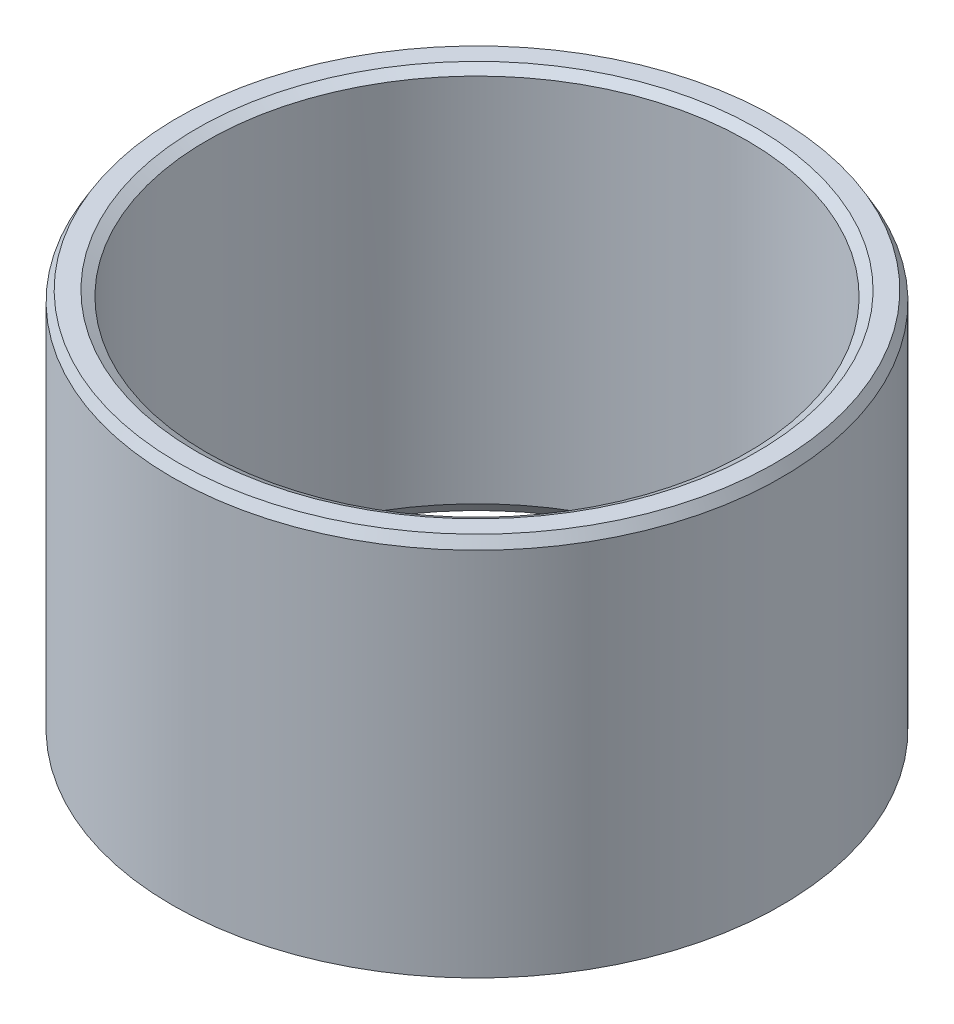
ISO-10303-21;
HEADER;
FILE_DESCRIPTION(('STEP AP214'),'2;1');
FILE_NAME('part.step','',(''),(''),'','','');
FILE_SCHEMA(('AUTOMOTIVE_DESIGN { 1 0 10303 214 1 1 1 1 }'));
ENDSEC;
DATA;
#1=APPLICATION_CONTEXT('core data for automotive mechanical design processes');
#2=APPLICATION_PROTOCOL_DEFINITION('international standard','automotive_design',2000,#1);
#3=PRODUCT_CONTEXT('',#1,'mechanical');
#4=PRODUCT('Part','Part','',(#3));
#5=PRODUCT_RELATED_PRODUCT_CATEGORY('part','',(#4));
#6=PRODUCT_DEFINITION_FORMATION('','',#4);
#7=PRODUCT_DEFINITION_CONTEXT('part definition',#1,'design');
#8=PRODUCT_DEFINITION('design','',#6,#7);
#9=PRODUCT_DEFINITION_SHAPE('','',#8);
#10=(LENGTH_UNIT() NAMED_UNIT(*) SI_UNIT(.MILLI.,.METRE.));
#11=(NAMED_UNIT(*) PLANE_ANGLE_UNIT() SI_UNIT($,.RADIAN.));
#12=(NAMED_UNIT(*) SI_UNIT($,.STERADIAN.) SOLID_ANGLE_UNIT());
#13=UNCERTAINTY_MEASURE_WITH_UNIT(LENGTH_MEASURE(1.E-05),#10,'distance_accuracy_value','');
#14=(GEOMETRIC_REPRESENTATION_CONTEXT(3) GLOBAL_UNCERTAINTY_ASSIGNED_CONTEXT((#13)) GLOBAL_UNIT_ASSIGNED_CONTEXT((#10,
#11,#12)) REPRESENTATION_CONTEXT('',''));
#15=CARTESIAN_POINT('',(0.,0.,0.));
#16=DIRECTION('',(0.,0.,1.));
#17=DIRECTION('',(1.,0.,0.));
#18=AXIS2_PLACEMENT_3D('',#15,#16,#17);
#19=CARTESIAN_POINT('',(0.,66.5105511024131,0.));
#20=DIRECTION('',(0.,-1.,0.));
#21=DIRECTION('',(0.,0.,-1.));
#22=AXIS2_PLACEMENT_3D('',#19,#20,#21);
#23=CYLINDRICAL_SURFACE('',#22,52.5);
#24=CARTESIAN_POINT('',(0.,0.983717591892544,0.));
#25=DIRECTION('',(0.,1.,0.));
#26=DIRECTION('',(0.,0.,1.));
#27=AXIS2_PLACEMENT_3D('',#24,#25,#26);
#28=CIRCLE('',#27,52.5);
#29=CARTESIAN_POINT('',(0.,0.983717591892544,52.5));
#30=VERTEX_POINT('',#29);
#31=EDGE_CURVE('E10',#30,#30,#28,.T.);
#32=ORIENTED_EDGE('',*,*,#31,.T.);
#33=EDGE_LOOP('',(#32));
#34=FACE_BOUND('',#33,.T.);
#35=CARTESIAN_POINT('',(0.,64.8067022529559,0.));
#36=DIRECTION('',(0.,1.,0.));
#37=DIRECTION('',(0.,0.,1.));
#38=AXIS2_PLACEMENT_3D('',#35,#36,#37);
#39=CIRCLE('',#38,52.5);
#40=CARTESIAN_POINT('',(0.,64.8067022529559,52.5));
#41=VERTEX_POINT('',#40);
#42=EDGE_CURVE('E50',#41,#41,#39,.F.);
#43=ORIENTED_EDGE('',*,*,#42,.T.);
#44=EDGE_LOOP('',(#43));
#45=FACE_BOUND('',#44,.T.);
#46=ADVANCED_FACE('F39',(#34,#45),#23,.T.);
#47=CARTESIAN_POINT('',(0.,66.5105511024131,0.));
#48=DIRECTION('',(0.,1.,0.));
#49=DIRECTION('',(0.,0.,1.));
#50=AXIS2_PLACEMENT_3D('',#47,#48,#49);
#51=PLANE('',#50);
#52=CARTESIAN_POINT('',(0.,66.5105511024131,0.));
#53=DIRECTION('',(0.,1.,0.));
#54=DIRECTION('',(0.,0.,1.));
#55=AXIS2_PLACEMENT_3D('',#52,#53,#54);
#56=CIRCLE('',#55,48.2572991377048);
#57=CARTESIAN_POINT('',(0.,66.5105511024131,48.2572991377048));
#58=VERTEX_POINT('',#57);
#59=EDGE_CURVE('E58',#58,#58,#56,.F.);
#60=ORIENTED_EDGE('',*,*,#59,.T.);
#61=EDGE_LOOP('',(#60));
#62=FACE_BOUND('',#61,.T.);
#63=CARTESIAN_POINT('',(0.,66.5105511024131,0.));
#64=DIRECTION('',(0.,1.,0.));
#65=DIRECTION('',(0.,0.,1.));
#66=AXIS2_PLACEMENT_3D('',#63,#64,#65);
#67=CIRCLE('',#66,51.5162824081075);
#68=CARTESIAN_POINT('',(0.,66.5105511024131,51.5162824081075));
#69=VERTEX_POINT('',#68);
#70=EDGE_CURVE('E61',#69,#69,#67,.T.);
#71=ORIENTED_EDGE('',*,*,#70,.T.);
#72=EDGE_LOOP('',(#71));
#73=FACE_BOUND('',#72,.T.);
#74=ADVANCED_FACE('F88',(#62,#73),#51,.T.);
#75=CARTESIAN_POINT('',(0.,0.,0.));
#76=DIRECTION('',(0.,1.,0.));
#77=DIRECTION('',(0.,0.,1.));
#78=AXIS2_PLACEMENT_3D('',#75,#76,#77);
#79=PLANE('',#78);
#80=CARTESIAN_POINT('',(0.,0.,0.));
#81=DIRECTION('',(0.,1.,0.));
#82=DIRECTION('',(0.,0.,1.));
#83=AXIS2_PLACEMENT_3D('',#80,#81,#82);
#84=CIRCLE('',#83,47.5371678801401);
#85=CARTESIAN_POINT('',(0.,0.,-47.5371678801401));
#86=VERTEX_POINT('',#85);
#87=EDGE_CURVE('E51',#86,#86,#84,.T.);
#88=ORIENTED_EDGE('',*,*,#87,.T.);
#89=EDGE_LOOP('',(#88));
#90=FACE_BOUND('',#89,.T.);
#91=CARTESIAN_POINT('',(0.,0.,0.));
#92=DIRECTION('',(0.,1.,0.));
#93=DIRECTION('',(0.,0.,1.));
#94=AXIS2_PLACEMENT_3D('',#91,#92,#93);
#95=CIRCLE('',#94,50.7961511505428);
#96=CARTESIAN_POINT('',(0.,0.,50.7961511505428));
#97=VERTEX_POINT('',#96);
#98=EDGE_CURVE('E54',#97,#97,#95,.F.);
#99=ORIENTED_EDGE('',*,*,#98,.T.);
#100=EDGE_LOOP('',(#99));
#101=FACE_BOUND('',#100,.T.);
#102=ADVANCED_FACE('F83',(#90,#101),#79,.F.);
#103=CARTESIAN_POINT('',(0.,66.5105511024131,0.));
#104=DIRECTION('',(0.,-1.,0.));
#105=DIRECTION('',(0.,0.,-1.));
#106=AXIS2_PLACEMENT_3D('',#103,#104,#105);
#107=CYLINDRICAL_SURFACE('',#106,46.5534502882476);
#108=CARTESIAN_POINT('',(0.,65.5268335105205,0.));
#109=DIRECTION('',(0.,1.,0.));
#110=DIRECTION('',(0.,0.,1.));
#111=AXIS2_PLACEMENT_3D('',#108,#109,#110);
#112=CIRCLE('',#111,46.5534502882476);
#113=CARTESIAN_POINT('',(0.,65.5268335105205,46.5534502882476));
#114=VERTEX_POINT('',#113);
#115=EDGE_CURVE('E67',#114,#114,#112,.T.);
#116=ORIENTED_EDGE('',*,*,#115,.T.);
#117=EDGE_LOOP('',(#116));
#118=FACE_BOUND('',#117,.T.);
#119=CARTESIAN_POINT('',(0.,1.70384884945726,0.));
#120=DIRECTION('',(0.,1.,0.));
#121=DIRECTION('',(0.,0.,1.));
#122=AXIS2_PLACEMENT_3D('',#119,#120,#121);
#123=CIRCLE('',#122,46.5534502882476);
#124=CARTESIAN_POINT('',(0.,1.70384884945726,-46.5534502882476));
#125=VERTEX_POINT('',#124);
#126=EDGE_CURVE('E69',#125,#125,#123,.F.);
#127=ORIENTED_EDGE('',*,*,#126,.T.);
#128=EDGE_LOOP('',(#127));
#129=FACE_BOUND('',#128,.T.);
#130=ADVANCED_FACE('F71',(#118,#129),#107,.F.);
#131=CARTESIAN_POINT('',(0.,65.5268335105205,0.));
#132=DIRECTION('',(0.,1.,0.));
#133=DIRECTION('',(0.,0.,1.));
#134=AXIS2_PLACEMENT_3D('',#131,#132,#133);
#135=CONICAL_SURFACE('',#134,46.5534502882476,1.0471975511966);
#136=ORIENTED_EDGE('',*,*,#59,.F.);
#137=EDGE_LOOP('',(#136));
#138=FACE_BOUND('',#137,.T.);
#139=ORIENTED_EDGE('',*,*,#115,.F.);
#140=EDGE_LOOP('',(#139));
#141=FACE_BOUND('',#140,.T.);
#142=ADVANCED_FACE('F77',(#138,#141),#135,.F.);
#143=CARTESIAN_POINT('',(0.,0.,0.));
#144=DIRECTION('',(0.,-1.,0.));
#145=DIRECTION('',(0.,0.,-1.));
#146=AXIS2_PLACEMENT_3D('',#143,#144,#145);
#147=CONICAL_SURFACE('',#146,47.5371678801401,0.52359877559829);
#148=CARTESIAN_POINT('',(0.,1.70384884945726,-46.5534502882476));
#149=CARTESIAN_POINT('',(0.,1.68610042394208,-46.5636973464965));
#150=CARTESIAN_POINT('',(0.,1.6683519984269,-46.5739444047453));
#151=CARTESIAN_POINT('',(0.,1.63285514739654,-46.5944385212431));
#152=CARTESIAN_POINT('',(0.,1.61510672188136,-46.604685579492));
#153=CARTESIAN_POINT('',(0.,1.579609870851,-46.6251796959897));
#154=CARTESIAN_POINT('',(0.,1.56186144533582,-46.6354267542386));
#155=CARTESIAN_POINT('',(0.,1.52636459430546,-46.6559208707364));
#156=CARTESIAN_POINT('',(0.,1.50861616879028,-46.6661679289853));
#157=CARTESIAN_POINT('',(0.,1.47311931775993,-46.686662045483));
#158=CARTESIAN_POINT('',(0.,1.45537089224474,-46.6969091037319));
#159=CARTESIAN_POINT('',(0.,1.41987404121439,-46.7174032202297));
#160=CARTESIAN_POINT('',(0.,1.40212561569921,-46.7276502784785));
#161=CARTESIAN_POINT('',(0.,1.36662876466885,-46.7481443949763));
#162=CARTESIAN_POINT('',(0.,1.34888033915367,-46.7583914532252));
#163=CARTESIAN_POINT('',(0.,1.31338348812331,-46.7788855697229));
#164=CARTESIAN_POINT('',(0.,1.29563506260813,-46.7891326279718));
#165=CARTESIAN_POINT('',(0.,1.26013821157777,-46.8096267444696));
#166=CARTESIAN_POINT('',(0.,1.24238978606259,-46.8198738027185));
#167=CARTESIAN_POINT('',(0.,1.20689293503223,-46.8403679192162));
#168=CARTESIAN_POINT('',(0.,1.18914450951705,-46.8506149774651));
#169=CARTESIAN_POINT('',(0.,1.15364765848669,-46.8711090939629));
#170=CARTESIAN_POINT('',(0.,1.13589923297151,-46.8813561522118));
#171=CARTESIAN_POINT('',(0.,1.10040238194115,-46.9018502687095));
#172=CARTESIAN_POINT('',(0.,1.08265395642597,-46.9120973269584));
#173=CARTESIAN_POINT('',(0.,1.04715710539561,-46.9325914434562));
#174=CARTESIAN_POINT('',(0.,1.02940867988043,-46.942838501705));
#175=CARTESIAN_POINT('',(0.,0.99391182885007,-46.9633326182028));
#176=CARTESIAN_POINT('',(0.,0.97616340333489,-46.9735796764517));
#177=CARTESIAN_POINT('',(0.,0.94066655230453,-46.9940737929494));
#178=CARTESIAN_POINT('',(0.,0.92291812678935,-47.0043208511983));
#179=CARTESIAN_POINT('',(0.,0.88742127575899,-47.0248149676961));
#180=CARTESIAN_POINT('',(0.,0.869672850243811,-47.035062025945));
#181=CARTESIAN_POINT('',(0.,0.834175999213452,-47.0555561424427));
#182=CARTESIAN_POINT('',(0.,0.816427573698272,-47.0658032006916));
#183=CARTESIAN_POINT('',(0.,0.780930722667912,-47.0862973171894));
#184=CARTESIAN_POINT('',(0.,0.763182297152732,-47.0965443754383));
#185=CARTESIAN_POINT('',(0.,0.727685446122372,-47.117038491936));
#186=CARTESIAN_POINT('',(0.,0.709937020607193,-47.1272855501849));
#187=CARTESIAN_POINT('',(0.,0.674440169576833,-47.1477796666827));
#188=CARTESIAN_POINT('',(0.,0.656691744061653,-47.1580267249315));
#189=CARTESIAN_POINT('',(0.,0.621194893031293,-47.1785208414293));
#190=CARTESIAN_POINT('',(0.,0.603446467516114,-47.1887678996782));
#191=CARTESIAN_POINT('',(0.,0.567949616485754,-47.2092620161759));
#192=CARTESIAN_POINT('',(0.,0.550201190970574,-47.2195090744248));
#193=CARTESIAN_POINT('',(0.,0.514704339940214,-47.2400031909226));
#194=CARTESIAN_POINT('',(0.,0.496955914425035,-47.2502502491715));
#195=CARTESIAN_POINT('',(0.,0.461459063394676,-47.2707443656692));
#196=CARTESIAN_POINT('',(0.,0.443710637879496,-47.2809914239181));
#197=CARTESIAN_POINT('',(0.,0.408213786849136,-47.3014855404159));
#198=CARTESIAN_POINT('',(0.,0.390465361333956,-47.3117325986648));
#199=CARTESIAN_POINT('',(0.,0.354968510303596,-47.3322267151625));
#200=CARTESIAN_POINT('',(0.,0.337220084788416,-47.3424737734114));
#201=CARTESIAN_POINT('',(0.,0.301723233758057,-47.3629678899092));
#202=CARTESIAN_POINT('',(0.,0.283974808242877,-47.373214948158));
#203=CARTESIAN_POINT('',(0.,0.248477957212517,-47.3937090646558));
#204=CARTESIAN_POINT('',(0.,0.230729531697337,-47.4039561229047));
#205=CARTESIAN_POINT('',(0.,0.195232680666978,-47.4244502394024));
#206=CARTESIAN_POINT('',(0.,0.177484255151798,-47.4346972976513));
#207=CARTESIAN_POINT('',(0.,0.141987404121439,-47.4551914141491));
#208=CARTESIAN_POINT('',(0.,0.124238978606259,-47.465438472398));
#209=CARTESIAN_POINT('',(0.,0.0887421275758989,-47.4859325888957));
#210=CARTESIAN_POINT('',(0.,0.0709937020607192,-47.4961796471446));
#211=CARTESIAN_POINT('',(0.,0.0354968510303597,-47.5166737636424));
#212=CARTESIAN_POINT('',(0.,0.01774842551518,-47.5269208218913));
#213=CARTESIAN_POINT('',(0.,0.,-47.5371678801401));
#214=B_SPLINE_CURVE_WITH_KNOTS('',3,(#148,#149,#150,#151,#152,#153,#154,#155,#156,#157,#158,
#159,#160,#161,#162,#163,#164,#165,#166,#167,#168,#169,#170,#171,#172,#173,#174,#175,#176,#177,
#178,#179,#180,#181,#182,#183,#184,#185,#186,#187,#188,#189,#190,#191,#192,#193,#194,#195,#196,
#197,#198,#199,#200,#201,#202,#203,#204,#205,#206,#207,#208,#209,#210,#211,#212,#213),
.UNSPECIFIED.,.F.,.F.,(4,2,2,2,2,2,2,2,2,2,2,2,2,2,2,2,2,2,2,2,2,2,2,2,2,2,2,2,2,2,2,2,4),(0.,
0.0614823494932857,0.122964698986571,0.184447048479857,0.245929397973146,0.307411747466432,
0.368894096959718,0.430376446453003,0.491858795946289,0.553341145439575,0.614823494932864,
0.676305844426149,0.737788193919435,0.799270543412721,0.860752892906007,0.922235242399292,
0.983717591892581,1.04519994138587,1.10668229087915,1.16816464037244,1.22964698986572,
1.29112933935901,1.3526116888523,1.41409403834559,1.47557638783887,1.53705873733216,
1.59854108682544,1.66002343631873,1.72150578581201,1.7829881353053,1.84447048479859,
1.90595283429187,1.96743518378516),.UNSPECIFIED.);
#215=EDGE_CURVE('BSEAM73',#125,#86,#214,.T.);
#216=ORIENTED_EDGE('',*,*,#126,.F.);
#217=ORIENTED_EDGE('',*,*,#87,.F.);
#218=ORIENTED_EDGE('',*,*,#215,.T.);
#219=ORIENTED_EDGE('',*,*,#215,.F.);
#220=EDGE_LOOP('',(#216,#218,#217,#219));
#221=FACE_BOUND('',#220,.T.);
#222=ADVANCED_FACE('F73',(#221),#147,.F.);
#223=CARTESIAN_POINT('',(0.,0.983717591892544,0.));
#224=DIRECTION('',(0.,1.,0.));
#225=DIRECTION('',(0.,0.,1.));
#226=AXIS2_PLACEMENT_3D('',#223,#224,#225);
#227=CONICAL_SURFACE('',#226,52.5,1.0471975511966);
#228=ORIENTED_EDGE('',*,*,#98,.F.);
#229=EDGE_LOOP('',(#228));
#230=FACE_BOUND('',#229,.T.);
#231=ORIENTED_EDGE('',*,*,#31,.F.);
#232=EDGE_LOOP('',(#231));
#233=FACE_BOUND('',#232,.T.);
#234=ADVANCED_FACE('F76',(#230,#233),#227,.T.);
#235=CARTESIAN_POINT('',(0.,66.5105511024131,0.));
#236=DIRECTION('',(0.,-1.,0.));
#237=DIRECTION('',(0.,0.,-1.));
#238=AXIS2_PLACEMENT_3D('',#235,#236,#237);
#239=CONICAL_SURFACE('',#238,51.5162824081075,0.523598775598295);
#240=ORIENTED_EDGE('',*,*,#42,.F.);
#241=EDGE_LOOP('',(#240));
#242=FACE_BOUND('',#241,.T.);
#243=ORIENTED_EDGE('',*,*,#70,.F.);
#244=EDGE_LOOP('',(#243));
#245=FACE_BOUND('',#244,.T.);
#246=ADVANCED_FACE('F45',(#242,#245),#239,.T.);
#247=CLOSED_SHELL('',(#46,#74,#102,#130,#142,#222,#234,#246));
#248=MANIFOLD_SOLID_BREP('B2',#247);
#249=ADVANCED_BREP_SHAPE_REPRESENTATION('',(#18,#248),#14);
#250=SHAPE_DEFINITION_REPRESENTATION(#9,#249);
ENDSEC;
END-ISO-10303-21;
